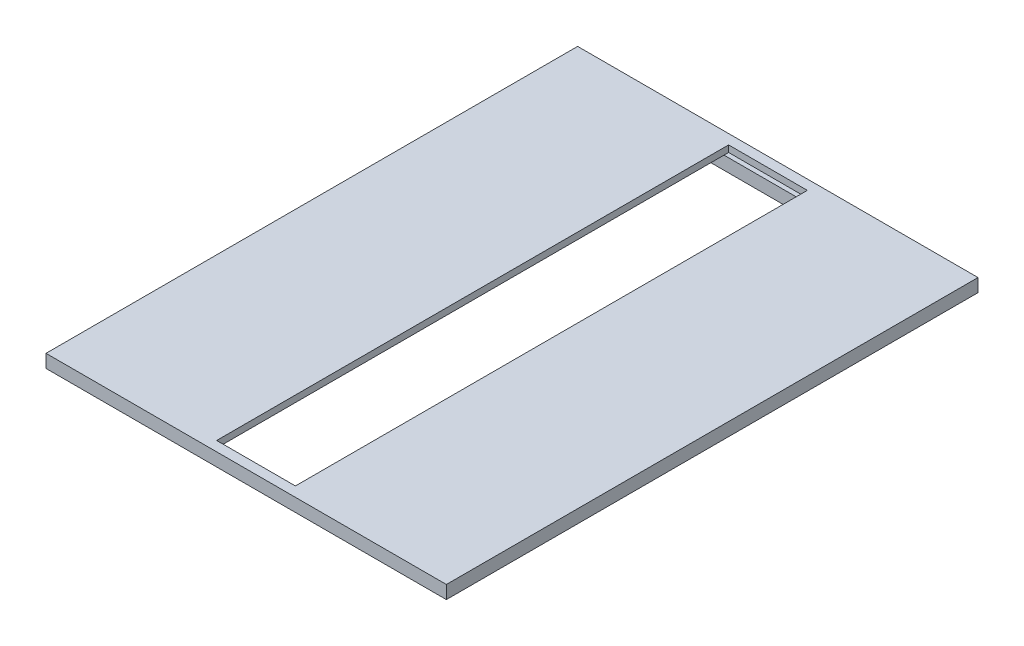
ISO-10303-21;
HEADER;
FILE_DESCRIPTION(('STEP AP214'),'2;1');
FILE_NAME('part.step','',(''),(''),'','','');
FILE_SCHEMA(('AUTOMOTIVE_DESIGN { 1 0 10303 214 1 1 1 1 }'));
ENDSEC;
DATA;
#1=APPLICATION_CONTEXT('core data for automotive mechanical design processes');
#2=APPLICATION_PROTOCOL_DEFINITION('international standard','automotive_design',2000,#1);
#3=PRODUCT_CONTEXT('',#1,'mechanical');
#4=PRODUCT('Part','Part','',(#3));
#5=PRODUCT_RELATED_PRODUCT_CATEGORY('part','',(#4));
#6=PRODUCT_DEFINITION_FORMATION('','',#4);
#7=PRODUCT_DEFINITION_CONTEXT('part definition',#1,'design');
#8=PRODUCT_DEFINITION('design','',#6,#7);
#9=PRODUCT_DEFINITION_SHAPE('','',#8);
#10=(LENGTH_UNIT() NAMED_UNIT(*) SI_UNIT(.MILLI.,.METRE.));
#11=(NAMED_UNIT(*) PLANE_ANGLE_UNIT() SI_UNIT($,.RADIAN.));
#12=(NAMED_UNIT(*) SI_UNIT($,.STERADIAN.) SOLID_ANGLE_UNIT());
#13=UNCERTAINTY_MEASURE_WITH_UNIT(LENGTH_MEASURE(1.E-05),#10,'distance_accuracy_value','');
#14=(GEOMETRIC_REPRESENTATION_CONTEXT(3) GLOBAL_UNCERTAINTY_ASSIGNED_CONTEXT((#13)) GLOBAL_UNIT_ASSIGNED_CONTEXT((#10,
#11,#12)) REPRESENTATION_CONTEXT('',''));
#15=CARTESIAN_POINT('',(0.,0.,0.));
#16=DIRECTION('',(0.,0.,1.));
#17=DIRECTION('',(1.,0.,0.));
#18=AXIS2_PLACEMENT_3D('',#15,#16,#17);
#19=CARTESIAN_POINT('',(0.,-2.5,0.));
#20=DIRECTION('',(0.,-1.,0.));
#21=DIRECTION('',(0.,0.,-1.));
#22=AXIS2_PLACEMENT_3D('',#19,#20,#21);
#23=PLANE('',#22);
#24=DIRECTION('',(-1.,0.,0.));
#25=VECTOR('',#24,1.);
#26=CARTESIAN_POINT('',(-70.75,-2.5,95.75));
#27=LINE('',#26,#25);
#28=CARTESIAN_POINT('',(70.75,-2.5,95.75));
#29=VERTEX_POINT('',#28);
#30=CARTESIAN_POINT('',(15.,-2.5,95.75));
#31=VERTEX_POINT('',#30);
#32=EDGE_CURVE('E339',#29,#31,#27,.T.);
#33=ORIENTED_EDGE('',*,*,#32,.T.);
#34=DIRECTION('',(0.,0.,-1.));
#35=VECTOR('',#34,1.);
#36=CARTESIAN_POINT('',(15.,-2.5,97.5));
#37=LINE('',#36,#35);
#38=CARTESIAN_POINT('',(15.,-2.5,-95.75));
#39=VERTEX_POINT('',#38);
#40=EDGE_CURVE('E303',#31,#39,#37,.T.);
#41=ORIENTED_EDGE('',*,*,#40,.T.);
#42=DIRECTION('',(1.,0.,0.));
#43=VECTOR('',#42,1.);
#44=CARTESIAN_POINT('',(70.75,-2.5,-95.75));
#45=LINE('',#44,#43);
#46=CARTESIAN_POINT('',(70.75,-2.5,-95.75));
#47=VERTEX_POINT('',#46);
#48=EDGE_CURVE('E345',#39,#47,#45,.T.);
#49=ORIENTED_EDGE('',*,*,#48,.T.);
#50=DIRECTION('',(0.,0.,1.));
#51=VECTOR('',#50,1.);
#52=CARTESIAN_POINT('',(70.75,-2.5,-95.75));
#53=LINE('',#52,#51);
#54=EDGE_CURVE('E319',#47,#29,#53,.T.);
#55=ORIENTED_EDGE('',*,*,#54,.T.);
#56=EDGE_LOOP('',(#33,#41,#49,#55));
#57=FACE_BOUND('',#56,.T.);
#58=DIRECTION('',(-1.,0.,0.));
#59=VECTOR('',#58,1.);
#60=CARTESIAN_POINT('',(25.,-2.5,92.75));
#61=LINE('',#60,#59);
#62=CARTESIAN_POINT('',(25.,-2.5,92.75));
#63=VERTEX_POINT('',#62);
#64=CARTESIAN_POINT('',(20.,-2.5,92.75));
#65=VERTEX_POINT('',#64);
#66=EDGE_CURVE('E774',#63,#65,#61,.T.);
#67=ORIENTED_EDGE('',*,*,#66,.F.);
#68=DIRECTION('',(0.,0.,1.));
#69=VECTOR('',#68,1.);
#70=CARTESIAN_POINT('',(25.,-2.5,92.75));
#71=LINE('',#70,#69);
#72=CARTESIAN_POINT('',(25.,-2.5,-92.75));
#73=VERTEX_POINT('',#72);
#74=EDGE_CURVE('E256',#73,#63,#71,.T.);
#75=ORIENTED_EDGE('',*,*,#74,.F.);
#76=DIRECTION('',(1.,0.,0.));
#77=VECTOR('',#76,1.);
#78=CARTESIAN_POINT('',(25.,-2.5,-92.75));
#79=LINE('',#78,#77);
#80=CARTESIAN_POINT('',(20.,-2.5,-92.75));
#81=VERTEX_POINT('',#80);
#82=EDGE_CURVE('E252',#81,#73,#79,.T.);
#83=ORIENTED_EDGE('',*,*,#82,.F.);
#84=DIRECTION('',(0.,0.,-1.));
#85=VECTOR('',#84,1.);
#86=CARTESIAN_POINT('',(20.,-2.5,-92.75));
#87=LINE('',#86,#85);
#88=EDGE_CURVE('E771',#65,#81,#87,.T.);
#89=ORIENTED_EDGE('',*,*,#88,.F.);
#90=EDGE_LOOP('',(#67,#75,#83,#89));
#91=FACE_BOUND('',#90,.T.);
#92=ADVANCED_FACE('F34',(#57,#91),#23,.T.);
#93=CARTESIAN_POINT('',(-70.75,-2.5,-95.75));
#94=VERTEX_POINT('',#93);
#95=CARTESIAN_POINT('',(-15.,-2.5,-95.75));
#96=VERTEX_POINT('',#95);
#97=EDGE_CURVE('E329',#94,#96,#45,.T.);
#98=ORIENTED_EDGE('',*,*,#97,.T.);
#99=DIRECTION('',(0.,0.,1.));
#100=VECTOR('',#99,1.);
#101=CARTESIAN_POINT('',(-15.,-2.5,97.5));
#102=LINE('',#101,#100);
#103=CARTESIAN_POINT('',(-15.,-2.5,95.75));
#104=VERTEX_POINT('',#103);
#105=EDGE_CURVE('E294',#96,#104,#102,.T.);
#106=ORIENTED_EDGE('',*,*,#105,.T.);
#107=CARTESIAN_POINT('',(-70.75,-2.5,95.75));
#108=VERTEX_POINT('',#107);
#109=EDGE_CURVE('E338',#104,#108,#27,.T.);
#110=ORIENTED_EDGE('',*,*,#109,.T.);
#111=DIRECTION('',(0.,0.,-1.));
#112=VECTOR('',#111,1.);
#113=CARTESIAN_POINT('',(-70.75,-2.5,-95.75));
#114=LINE('',#113,#112);
#115=EDGE_CURVE('E342',#108,#94,#114,.T.);
#116=ORIENTED_EDGE('',*,*,#115,.T.);
#117=EDGE_LOOP('',(#98,#106,#110,#116));
#118=FACE_BOUND('',#117,.T.);
#119=DIRECTION('',(0.,0.,-1.));
#120=VECTOR('',#119,1.);
#121=CARTESIAN_POINT('',(-25.,-2.5,92.75));
#122=LINE('',#121,#120);
#123=CARTESIAN_POINT('',(-25.,-2.5,92.75));
#124=VERTEX_POINT('',#123);
#125=CARTESIAN_POINT('',(-25.,-2.5,-92.75));
#126=VERTEX_POINT('',#125);
#127=EDGE_CURVE('E261',#124,#126,#122,.T.);
#128=ORIENTED_EDGE('',*,*,#127,.F.);
#129=DIRECTION('',(-1.,0.,0.));
#130=VECTOR('',#129,1.);
#131=CARTESIAN_POINT('',(-25.,-2.5,92.75));
#132=LINE('',#131,#130);
#133=CARTESIAN_POINT('',(-20.,-2.5,92.75));
#134=VERTEX_POINT('',#133);
#135=EDGE_CURVE('E258',#134,#124,#132,.T.);
#136=ORIENTED_EDGE('',*,*,#135,.F.);
#137=DIRECTION('',(0.,0.,1.));
#138=VECTOR('',#137,1.);
#139=CARTESIAN_POINT('',(-20.,-2.5,-92.75));
#140=LINE('',#139,#138);
#141=CARTESIAN_POINT('',(-20.,-2.5,-92.75));
#142=VERTEX_POINT('',#141);
#143=EDGE_CURVE('E270',#142,#134,#140,.T.);
#144=ORIENTED_EDGE('',*,*,#143,.F.);
#145=DIRECTION('',(1.,0.,0.));
#146=VECTOR('',#145,1.);
#147=CARTESIAN_POINT('',(-25.,-2.5,-92.75));
#148=LINE('',#147,#146);
#149=EDGE_CURVE('E278',#126,#142,#148,.T.);
#150=ORIENTED_EDGE('',*,*,#149,.F.);
#151=EDGE_LOOP('',(#128,#136,#144,#150));
#152=FACE_BOUND('',#151,.T.);
#153=ADVANCED_FACE('F473',(#118,#152),#23,.T.);
#154=DIRECTION('',(0.,0.,-1.));
#155=VECTOR('',#154,1.);
#156=CARTESIAN_POINT('',(-75.75,-2.5,-100.75));
#157=LINE('',#156,#155);
#158=CARTESIAN_POINT('',(-75.75,-2.5,100.75));
#159=VERTEX_POINT('',#158);
#160=CARTESIAN_POINT('',(-75.75,-2.5,-100.75));
#161=VERTEX_POINT('',#160);
#162=EDGE_CURVE('E390',#159,#161,#157,.T.);
#163=ORIENTED_EDGE('',*,*,#162,.T.);
#164=DIRECTION('',(1.,0.,0.));
#165=VECTOR('',#164,1.);
#166=CARTESIAN_POINT('',(75.75,-2.5,-100.75));
#167=LINE('',#166,#165);
#168=CARTESIAN_POINT('',(75.75,-2.5,-100.75));
#169=VERTEX_POINT('',#168);
#170=EDGE_CURVE('E393',#161,#169,#167,.T.);
#171=ORIENTED_EDGE('',*,*,#170,.T.);
#172=DIRECTION('',(0.,0.,1.));
#173=VECTOR('',#172,1.);
#174=CARTESIAN_POINT('',(75.75,-2.5,-100.75));
#175=LINE('',#174,#173);
#176=CARTESIAN_POINT('',(75.75,-2.5,100.75));
#177=VERTEX_POINT('',#176);
#178=EDGE_CURVE('E397',#169,#177,#175,.T.);
#179=ORIENTED_EDGE('',*,*,#178,.T.);
#180=DIRECTION('',(-1.,0.,0.));
#181=VECTOR('',#180,1.);
#182=CARTESIAN_POINT('',(75.75,-2.5,100.75));
#183=LINE('',#182,#181);
#184=EDGE_CURVE('E400',#177,#159,#183,.T.);
#185=ORIENTED_EDGE('',*,*,#184,.T.);
#186=EDGE_LOOP('',(#163,#171,#179,#185));
#187=FACE_BOUND('',#186,.T.);
#188=DIRECTION('',(1.,0.,0.));
#189=VECTOR('',#188,1.);
#190=CARTESIAN_POINT('',(-73.25,-2.5,-98.25));
#191=LINE('',#190,#189);
#192=CARTESIAN_POINT('',(-73.25,-2.5,-98.25));
#193=VERTEX_POINT('',#192);
#194=CARTESIAN_POINT('',(73.25,-2.5,-98.25));
#195=VERTEX_POINT('',#194);
#196=EDGE_CURVE('E374',#193,#195,#191,.T.);
#197=ORIENTED_EDGE('',*,*,#196,.F.);
#198=DIRECTION('',(0.,0.,-1.));
#199=VECTOR('',#198,1.);
#200=CARTESIAN_POINT('',(-73.25,-2.5,98.25));
#201=LINE('',#200,#199);
#202=CARTESIAN_POINT('',(-73.25,-2.5,98.25));
#203=VERTEX_POINT('',#202);
#204=EDGE_CURVE('E360',#203,#193,#201,.T.);
#205=ORIENTED_EDGE('',*,*,#204,.F.);
#206=DIRECTION('',(-1.,0.,0.));
#207=VECTOR('',#206,1.);
#208=CARTESIAN_POINT('',(73.25,-2.5,98.25));
#209=LINE('',#208,#207);
#210=CARTESIAN_POINT('',(73.25,-2.5,98.25));
#211=VERTEX_POINT('',#210);
#212=EDGE_CURVE('E365',#211,#203,#209,.T.);
#213=ORIENTED_EDGE('',*,*,#212,.F.);
#214=DIRECTION('',(0.,0.,1.));
#215=VECTOR('',#214,1.);
#216=CARTESIAN_POINT('',(73.25,-2.5,98.25));
#217=LINE('',#216,#215);
#218=EDGE_CURVE('E376',#195,#211,#217,.T.);
#219=ORIENTED_EDGE('',*,*,#218,.F.);
#220=EDGE_LOOP('',(#197,#205,#213,#219));
#221=FACE_BOUND('',#220,.T.);
#222=ADVANCED_FACE('F476',(#187,#221),#23,.T.);
#223=CARTESIAN_POINT('',(-76.25,-5.,101.25));
#224=DIRECTION('',(-1.,0.,0.));
#225=DIRECTION('',(0.,0.,1.));
#226=AXIS2_PLACEMENT_3D('',#223,#224,#225);
#227=PLANE('',#226);
#228=DIRECTION('',(0.,0.,1.));
#229=VECTOR('',#228,1.);
#230=CARTESIAN_POINT('',(-76.25,0.,101.25));
#231=LINE('',#230,#229);
#232=CARTESIAN_POINT('',(-76.25,0.,-101.25));
#233=VERTEX_POINT('',#232);
#234=CARTESIAN_POINT('',(-76.25,0.,101.25));
#235=VERTEX_POINT('',#234);
#236=EDGE_CURVE('E415',#233,#235,#231,.T.);
#237=ORIENTED_EDGE('',*,*,#236,.F.);
#238=DIRECTION('',(0.,1.,0.));
#239=VECTOR('',#238,1.);
#240=CARTESIAN_POINT('',(-76.25,-5.,-101.25));
#241=LINE('',#240,#239);
#242=CARTESIAN_POINT('',(-76.25,-5.,-101.25));
#243=VERTEX_POINT('',#242);
#244=EDGE_CURVE('E11',#243,#233,#241,.T.);
#245=ORIENTED_EDGE('',*,*,#244,.F.);
#246=DIRECTION('',(0.,0.,1.));
#247=VECTOR('',#246,1.);
#248=CARTESIAN_POINT('',(-76.25,-5.,101.25));
#249=LINE('',#248,#247);
#250=CARTESIAN_POINT('',(-76.25,-5.,101.25));
#251=VERTEX_POINT('',#250);
#252=EDGE_CURVE('E422',#243,#251,#249,.T.);
#253=ORIENTED_EDGE('',*,*,#252,.T.);
#254=DIRECTION('',(0.,1.,0.));
#255=VECTOR('',#254,1.);
#256=CARTESIAN_POINT('',(-76.25,-5.,101.25));
#257=LINE('',#256,#255);
#258=EDGE_CURVE('E38',#251,#235,#257,.T.);
#259=ORIENTED_EDGE('',*,*,#258,.T.);
#260=EDGE_LOOP('',(#237,#245,#253,#259));
#261=FACE_BOUND('',#260,.T.);
#262=ADVANCED_FACE('F36',(#261),#227,.T.);
#263=CARTESIAN_POINT('',(76.25,-5.,-101.25));
#264=DIRECTION('',(0.,0.,-1.));
#265=DIRECTION('',(-1.,0.,0.));
#266=AXIS2_PLACEMENT_3D('',#263,#264,#265);
#267=PLANE('',#266);
#268=DIRECTION('',(-1.,0.,0.));
#269=VECTOR('',#268,1.);
#270=CARTESIAN_POINT('',(76.25,0.,-101.25));
#271=LINE('',#270,#269);
#272=CARTESIAN_POINT('',(76.25,0.,-101.25));
#273=VERTEX_POINT('',#272);
#274=EDGE_CURVE('E426',#273,#233,#271,.T.);
#275=ORIENTED_EDGE('',*,*,#274,.F.);
#276=DIRECTION('',(0.,1.,0.));
#277=VECTOR('',#276,1.);
#278=CARTESIAN_POINT('',(76.25,-5.,-101.25));
#279=LINE('',#278,#277);
#280=CARTESIAN_POINT('',(76.25,-5.,-101.25));
#281=VERTEX_POINT('',#280);
#282=EDGE_CURVE('E43',#281,#273,#279,.T.);
#283=ORIENTED_EDGE('',*,*,#282,.F.);
#284=DIRECTION('',(-1.,0.,0.));
#285=VECTOR('',#284,1.);
#286=CARTESIAN_POINT('',(76.25,-5.,-101.25));
#287=LINE('',#286,#285);
#288=EDGE_CURVE('E432',#281,#243,#287,.T.);
#289=ORIENTED_EDGE('',*,*,#288,.T.);
#290=ORIENTED_EDGE('',*,*,#244,.T.);
#291=EDGE_LOOP('',(#275,#283,#289,#290));
#292=FACE_BOUND('',#291,.T.);
#293=ADVANCED_FACE('F458',(#292),#267,.T.);
#294=CARTESIAN_POINT('',(76.25,-5.,101.25));
#295=DIRECTION('',(1.,0.,0.));
#296=DIRECTION('',(0.,0.,-1.));
#297=AXIS2_PLACEMENT_3D('',#294,#295,#296);
#298=PLANE('',#297);
#299=DIRECTION('',(0.,0.,-1.));
#300=VECTOR('',#299,1.);
#301=CARTESIAN_POINT('',(76.25,0.,101.25));
#302=LINE('',#301,#300);
#303=CARTESIAN_POINT('',(76.25,0.,101.25));
#304=VERTEX_POINT('',#303);
#305=EDGE_CURVE('E440',#304,#273,#302,.T.);
#306=ORIENTED_EDGE('',*,*,#305,.F.);
#307=DIRECTION('',(0.,1.,0.));
#308=VECTOR('',#307,1.);
#309=CARTESIAN_POINT('',(76.25,-5.,101.25));
#310=LINE('',#309,#308);
#311=CARTESIAN_POINT('',(76.25,-5.,101.25));
#312=VERTEX_POINT('',#311);
#313=EDGE_CURVE('E445',#312,#304,#310,.T.);
#314=ORIENTED_EDGE('',*,*,#313,.F.);
#315=DIRECTION('',(0.,0.,-1.));
#316=VECTOR('',#315,1.);
#317=CARTESIAN_POINT('',(76.25,-5.,101.25));
#318=LINE('',#317,#316);
#319=EDGE_CURVE('E429',#312,#281,#318,.T.);
#320=ORIENTED_EDGE('',*,*,#319,.T.);
#321=ORIENTED_EDGE('',*,*,#282,.T.);
#322=EDGE_LOOP('',(#306,#314,#320,#321));
#323=FACE_BOUND('',#322,.T.);
#324=ADVANCED_FACE('F464',(#323),#298,.T.);
#325=CARTESIAN_POINT('',(76.25,-5.,101.25));
#326=DIRECTION('',(0.,0.,1.));
#327=DIRECTION('',(1.,0.,0.));
#328=AXIS2_PLACEMENT_3D('',#325,#326,#327);
#329=PLANE('',#328);
#330=DIRECTION('',(1.,0.,0.));
#331=VECTOR('',#330,1.);
#332=CARTESIAN_POINT('',(76.25,0.,101.25));
#333=LINE('',#332,#331);
#334=EDGE_CURVE('E437',#235,#304,#333,.T.);
#335=ORIENTED_EDGE('',*,*,#334,.F.);
#336=ORIENTED_EDGE('',*,*,#258,.F.);
#337=DIRECTION('',(1.,0.,0.));
#338=VECTOR('',#337,1.);
#339=CARTESIAN_POINT('',(76.25,-5.,101.25));
#340=LINE('',#339,#338);
#341=EDGE_CURVE('E425',#251,#312,#340,.T.);
#342=ORIENTED_EDGE('',*,*,#341,.T.);
#343=ORIENTED_EDGE('',*,*,#313,.T.);
#344=EDGE_LOOP('',(#335,#336,#342,#343));
#345=FACE_BOUND('',#344,.T.);
#346=ADVANCED_FACE('F453',(#345),#329,.T.);
#347=CARTESIAN_POINT('',(0.,-5.,0.));
#348=DIRECTION('',(0.,1.,0.));
#349=DIRECTION('',(0.,0.,1.));
#350=AXIS2_PLACEMENT_3D('',#347,#348,#349);
#351=PLANE('',#350);
#352=DIRECTION('',(1.,0.,0.));
#353=VECTOR('',#352,1.);
#354=CARTESIAN_POINT('',(75.75,-5.,-100.75));
#355=LINE('',#354,#353);
#356=CARTESIAN_POINT('',(-75.75,-5.,-100.75));
#357=VERTEX_POINT('',#356);
#358=CARTESIAN_POINT('',(75.75,-5.,-100.75));
#359=VERTEX_POINT('',#358);
#360=EDGE_CURVE('E405',#357,#359,#355,.T.);
#361=ORIENTED_EDGE('',*,*,#360,.F.);
#362=DIRECTION('',(0.,0.,-1.));
#363=VECTOR('',#362,1.);
#364=CARTESIAN_POINT('',(-75.75,-5.,-100.75));
#365=LINE('',#364,#363);
#366=CARTESIAN_POINT('',(-75.75,-5.,100.75));
#367=VERTEX_POINT('',#366);
#368=EDGE_CURVE('E389',#367,#357,#365,.T.);
#369=ORIENTED_EDGE('',*,*,#368,.F.);
#370=DIRECTION('',(-1.,0.,0.));
#371=VECTOR('',#370,1.);
#372=CARTESIAN_POINT('',(75.75,-5.,100.75));
#373=LINE('',#372,#371);
#374=CARTESIAN_POINT('',(75.75,-5.,100.75));
#375=VERTEX_POINT('',#374);
#376=EDGE_CURVE('E394',#375,#367,#373,.T.);
#377=ORIENTED_EDGE('',*,*,#376,.F.);
#378=DIRECTION('',(0.,0.,1.));
#379=VECTOR('',#378,1.);
#380=CARTESIAN_POINT('',(75.75,-5.,-100.75));
#381=LINE('',#380,#379);
#382=EDGE_CURVE('E408',#359,#375,#381,.T.);
#383=ORIENTED_EDGE('',*,*,#382,.F.);
#384=EDGE_LOOP('',(#361,#369,#377,#383));
#385=FACE_BOUND('',#384,.T.);
#386=ORIENTED_EDGE('',*,*,#252,.F.);
#387=ORIENTED_EDGE('',*,*,#288,.F.);
#388=ORIENTED_EDGE('',*,*,#319,.F.);
#389=ORIENTED_EDGE('',*,*,#341,.F.);
#390=EDGE_LOOP('',(#386,#387,#388,#389));
#391=FACE_BOUND('',#390,.T.);
#392=ADVANCED_FACE('F461',(#385,#391),#351,.F.);
#393=CARTESIAN_POINT('',(0.,0.,0.));
#394=DIRECTION('',(0.,1.,0.));
#395=DIRECTION('',(0.,0.,1.));
#396=AXIS2_PLACEMENT_3D('',#393,#394,#395);
#397=PLANE('',#396);
#398=DIRECTION('',(0.,0.,1.));
#399=VECTOR('',#398,1.);
#400=CARTESIAN_POINT('',(-15.,0.,97.5));
#401=LINE('',#400,#399);
#402=CARTESIAN_POINT('',(-15.,0.,-97.5));
#403=VERTEX_POINT('',#402);
#404=CARTESIAN_POINT('',(-15.,0.,97.5));
#405=VERTEX_POINT('',#404);
#406=EDGE_CURVE('E289',#403,#405,#401,.T.);
#407=ORIENTED_EDGE('',*,*,#406,.F.);
#408=DIRECTION('',(-1.,0.,0.));
#409=VECTOR('',#408,1.);
#410=CARTESIAN_POINT('',(15.,0.,-97.5));
#411=LINE('',#410,#409);
#412=CARTESIAN_POINT('',(15.,0.,-97.5));
#413=VERTEX_POINT('',#412);
#414=EDGE_CURVE('E314',#413,#403,#411,.T.);
#415=ORIENTED_EDGE('',*,*,#414,.F.);
#416=DIRECTION('',(0.,0.,-1.));
#417=VECTOR('',#416,1.);
#418=CARTESIAN_POINT('',(15.,0.,97.5));
#419=LINE('',#418,#417);
#420=CARTESIAN_POINT('',(15.,0.,97.5));
#421=VERTEX_POINT('',#420);
#422=EDGE_CURVE('E311',#421,#413,#419,.T.);
#423=ORIENTED_EDGE('',*,*,#422,.F.);
#424=DIRECTION('',(1.,0.,0.));
#425=VECTOR('',#424,1.);
#426=CARTESIAN_POINT('',(15.,0.,97.5));
#427=LINE('',#426,#425);
#428=EDGE_CURVE('E308',#405,#421,#427,.T.);
#429=ORIENTED_EDGE('',*,*,#428,.F.);
#430=EDGE_LOOP('',(#407,#415,#423,#429));
#431=FACE_BOUND('',#430,.T.);
#432=ORIENTED_EDGE('',*,*,#236,.T.);
#433=ORIENTED_EDGE('',*,*,#334,.T.);
#434=ORIENTED_EDGE('',*,*,#305,.T.);
#435=ORIENTED_EDGE('',*,*,#274,.T.);
#436=EDGE_LOOP('',(#432,#433,#434,#435));
#437=FACE_BOUND('',#436,.T.);
#438=ADVANCED_FACE('F455',(#431,#437),#397,.T.);
#439=CARTESIAN_POINT('',(-75.75,-2.5,-100.75));
#440=DIRECTION('',(-1.,0.,0.));
#441=DIRECTION('',(0.,0.,1.));
#442=AXIS2_PLACEMENT_3D('',#439,#440,#441);
#443=PLANE('',#442);
#444=ORIENTED_EDGE('',*,*,#368,.T.);
#445=DIRECTION('',(0.,-1.,0.));
#446=VECTOR('',#445,1.);
#447=CARTESIAN_POINT('',(-75.75,-2.5,-100.75));
#448=LINE('',#447,#446);
#449=EDGE_CURVE('E403',#161,#357,#448,.T.);
#450=ORIENTED_EDGE('',*,*,#449,.F.);
#451=ORIENTED_EDGE('',*,*,#162,.F.);
#452=DIRECTION('',(0.,-1.,0.));
#453=VECTOR('',#452,1.);
#454=CARTESIAN_POINT('',(-75.75,-2.5,100.75));
#455=LINE('',#454,#453);
#456=EDGE_CURVE('E413',#159,#367,#455,.T.);
#457=ORIENTED_EDGE('',*,*,#456,.T.);
#458=EDGE_LOOP('',(#444,#450,#451,#457));
#459=FACE_BOUND('',#458,.T.);
#460=ADVANCED_FACE('F545',(#459),#443,.F.);
#461=CARTESIAN_POINT('',(75.75,-2.5,100.75));
#462=DIRECTION('',(0.,0.,1.));
#463=DIRECTION('',(1.,0.,0.));
#464=AXIS2_PLACEMENT_3D('',#461,#462,#463);
#465=PLANE('',#464);
#466=ORIENTED_EDGE('',*,*,#376,.T.);
#467=ORIENTED_EDGE('',*,*,#456,.F.);
#468=ORIENTED_EDGE('',*,*,#184,.F.);
#469=DIRECTION('',(0.,-1.,0.));
#470=VECTOR('',#469,1.);
#471=CARTESIAN_POINT('',(75.75,-2.5,100.75));
#472=LINE('',#471,#470);
#473=EDGE_CURVE('E416',#177,#375,#472,.T.);
#474=ORIENTED_EDGE('',*,*,#473,.T.);
#475=EDGE_LOOP('',(#466,#467,#468,#474));
#476=FACE_BOUND('',#475,.T.);
#477=ADVANCED_FACE('F541',(#476),#465,.F.);
#478=CARTESIAN_POINT('',(75.75,-2.5,-100.75));
#479=DIRECTION('',(1.,0.,0.));
#480=DIRECTION('',(0.,0.,-1.));
#481=AXIS2_PLACEMENT_3D('',#478,#479,#480);
#482=PLANE('',#481);
#483=ORIENTED_EDGE('',*,*,#382,.T.);
#484=ORIENTED_EDGE('',*,*,#473,.F.);
#485=ORIENTED_EDGE('',*,*,#178,.F.);
#486=DIRECTION('',(0.,-1.,0.));
#487=VECTOR('',#486,1.);
#488=CARTESIAN_POINT('',(75.75,-2.5,-100.75));
#489=LINE('',#488,#487);
#490=EDGE_CURVE('E418',#169,#359,#489,.T.);
#491=ORIENTED_EDGE('',*,*,#490,.T.);
#492=EDGE_LOOP('',(#483,#484,#485,#491));
#493=FACE_BOUND('',#492,.T.);
#494=ADVANCED_FACE('F535',(#493),#482,.F.);
#495=CARTESIAN_POINT('',(75.75,-2.5,-100.75));
#496=DIRECTION('',(0.,0.,-1.));
#497=DIRECTION('',(-1.,0.,0.));
#498=AXIS2_PLACEMENT_3D('',#495,#496,#497);
#499=PLANE('',#498);
#500=ORIENTED_EDGE('',*,*,#360,.T.);
#501=ORIENTED_EDGE('',*,*,#490,.F.);
#502=ORIENTED_EDGE('',*,*,#170,.F.);
#503=ORIENTED_EDGE('',*,*,#449,.T.);
#504=EDGE_LOOP('',(#500,#501,#502,#503));
#505=FACE_BOUND('',#504,.T.);
#506=ADVANCED_FACE('F531',(#505),#499,.F.);
#507=CARTESIAN_POINT('',(0.,-7.5,0.));
#508=DIRECTION('',(0.,-1.,0.));
#509=DIRECTION('',(0.,0.,-1.));
#510=AXIS2_PLACEMENT_3D('',#507,#508,#509);
#511=PLANE('',#510);
#512=DIRECTION('',(0.,0.,-1.));
#513=VECTOR('',#512,1.);
#514=CARTESIAN_POINT('',(-73.25,-7.5,98.25));
#515=LINE('',#514,#513);
#516=CARTESIAN_POINT('',(-73.25,-7.5,98.25));
#517=VERTEX_POINT('',#516);
#518=CARTESIAN_POINT('',(-73.25,-7.5,-98.25));
#519=VERTEX_POINT('',#518);
#520=EDGE_CURVE('E361',#517,#519,#515,.T.);
#521=ORIENTED_EDGE('',*,*,#520,.T.);
#522=DIRECTION('',(1.,0.,0.));
#523=VECTOR('',#522,1.);
#524=CARTESIAN_POINT('',(-73.25,-7.5,-98.25));
#525=LINE('',#524,#523);
#526=CARTESIAN_POINT('',(73.25,-7.5,-98.25));
#527=VERTEX_POINT('',#526);
#528=EDGE_CURVE('E364',#519,#527,#525,.T.);
#529=ORIENTED_EDGE('',*,*,#528,.T.);
#530=DIRECTION('',(0.,0.,1.));
#531=VECTOR('',#530,1.);
#532=CARTESIAN_POINT('',(73.25,-7.5,98.25));
#533=LINE('',#532,#531);
#534=CARTESIAN_POINT('',(73.25,-7.5,98.25));
#535=VERTEX_POINT('',#534);
#536=EDGE_CURVE('E367',#527,#535,#533,.T.);
#537=ORIENTED_EDGE('',*,*,#536,.T.);
#538=DIRECTION('',(-1.,0.,0.));
#539=VECTOR('',#538,1.);
#540=CARTESIAN_POINT('',(73.25,-7.5,98.25));
#541=LINE('',#540,#539);
#542=EDGE_CURVE('E369',#535,#517,#541,.T.);
#543=ORIENTED_EDGE('',*,*,#542,.T.);
#544=EDGE_LOOP('',(#521,#529,#537,#543));
#545=FACE_BOUND('',#544,.T.);
#546=DIRECTION('',(-1.,0.,0.));
#547=VECTOR('',#546,1.);
#548=CARTESIAN_POINT('',(-70.75,-7.5,95.75));
#549=LINE('',#548,#547);
#550=CARTESIAN_POINT('',(70.75,-7.5,95.75));
#551=VERTEX_POINT('',#550);
#552=CARTESIAN_POINT('',(-70.75,-7.5,95.75));
#553=VERTEX_POINT('',#552);
#554=EDGE_CURVE('E328',#551,#553,#549,.T.);
#555=ORIENTED_EDGE('',*,*,#554,.F.);
#556=DIRECTION('',(0.,0.,1.));
#557=VECTOR('',#556,1.);
#558=CARTESIAN_POINT('',(70.75,-7.5,-95.75));
#559=LINE('',#558,#557);
#560=CARTESIAN_POINT('',(70.75,-7.5,-95.75));
#561=VERTEX_POINT('',#560);
#562=EDGE_CURVE('E326',#561,#551,#559,.T.);
#563=ORIENTED_EDGE('',*,*,#562,.F.);
#564=DIRECTION('',(1.,0.,0.));
#565=VECTOR('',#564,1.);
#566=CARTESIAN_POINT('',(70.75,-7.5,-95.75));
#567=LINE('',#566,#565);
#568=CARTESIAN_POINT('',(-70.75,-7.5,-95.75));
#569=VERTEX_POINT('',#568);
#570=EDGE_CURVE('E334',#569,#561,#567,.T.);
#571=ORIENTED_EDGE('',*,*,#570,.F.);
#572=DIRECTION('',(0.,0.,-1.));
#573=VECTOR('',#572,1.);
#574=CARTESIAN_POINT('',(-70.75,-7.5,-95.75));
#575=LINE('',#574,#573);
#576=EDGE_CURVE('E331',#553,#569,#575,.T.);
#577=ORIENTED_EDGE('',*,*,#576,.F.);
#578=EDGE_LOOP('',(#555,#563,#571,#577));
#579=FACE_BOUND('',#578,.T.);
#580=ADVANCED_FACE('F505',(#545,#579),#511,.T.);
#581=CARTESIAN_POINT('',(-73.25,-7.5,98.25));
#582=DIRECTION('',(1.,0.,0.));
#583=DIRECTION('',(0.,0.,-1.));
#584=AXIS2_PLACEMENT_3D('',#581,#582,#583);
#585=PLANE('',#584);
#586=ORIENTED_EDGE('',*,*,#204,.T.);
#587=DIRECTION('',(0.,1.,0.));
#588=VECTOR('',#587,1.);
#589=CARTESIAN_POINT('',(-73.25,-7.5,-98.25));
#590=LINE('',#589,#588);
#591=EDGE_CURVE('E387',#519,#193,#590,.T.);
#592=ORIENTED_EDGE('',*,*,#591,.F.);
#593=ORIENTED_EDGE('',*,*,#520,.F.);
#594=DIRECTION('',(0.,1.,0.));
#595=VECTOR('',#594,1.);
#596=CARTESIAN_POINT('',(-73.25,-7.5,98.25));
#597=LINE('',#596,#595);
#598=EDGE_CURVE('E371',#517,#203,#597,.T.);
#599=ORIENTED_EDGE('',*,*,#598,.T.);
#600=EDGE_LOOP('',(#586,#592,#593,#599));
#601=FACE_BOUND('',#600,.T.);
#602=ADVANCED_FACE('F510',(#601),#585,.F.);
#603=CARTESIAN_POINT('',(-73.25,-7.5,-98.25));
#604=DIRECTION('',(0.,0.,1.));
#605=DIRECTION('',(1.,0.,0.));
#606=AXIS2_PLACEMENT_3D('',#603,#604,#605);
#607=PLANE('',#606);
#608=ORIENTED_EDGE('',*,*,#196,.T.);
#609=DIRECTION('',(0.,1.,0.));
#610=VECTOR('',#609,1.);
#611=CARTESIAN_POINT('',(73.25,-7.5,-98.25));
#612=LINE('',#611,#610);
#613=EDGE_CURVE('E384',#527,#195,#612,.T.);
#614=ORIENTED_EDGE('',*,*,#613,.F.);
#615=ORIENTED_EDGE('',*,*,#528,.F.);
#616=ORIENTED_EDGE('',*,*,#591,.T.);
#617=EDGE_LOOP('',(#608,#614,#615,#616));
#618=FACE_BOUND('',#617,.T.);
#619=ADVANCED_FACE('F497',(#618),#607,.F.);
#620=CARTESIAN_POINT('',(73.25,-7.5,98.25));
#621=DIRECTION('',(-1.,0.,0.));
#622=DIRECTION('',(0.,0.,1.));
#623=AXIS2_PLACEMENT_3D('',#620,#621,#622);
#624=PLANE('',#623);
#625=ORIENTED_EDGE('',*,*,#218,.T.);
#626=DIRECTION('',(0.,1.,0.));
#627=VECTOR('',#626,1.);
#628=CARTESIAN_POINT('',(73.25,-7.5,98.25));
#629=LINE('',#628,#627);
#630=EDGE_CURVE('E382',#535,#211,#629,.T.);
#631=ORIENTED_EDGE('',*,*,#630,.F.);
#632=ORIENTED_EDGE('',*,*,#536,.F.);
#633=ORIENTED_EDGE('',*,*,#613,.T.);
#634=EDGE_LOOP('',(#625,#631,#632,#633));
#635=FACE_BOUND('',#634,.T.);
#636=ADVANCED_FACE('F501',(#635),#624,.F.);
#637=CARTESIAN_POINT('',(73.25,-7.5,98.25));
#638=DIRECTION('',(0.,0.,-1.));
#639=DIRECTION('',(-1.,0.,0.));
#640=AXIS2_PLACEMENT_3D('',#637,#638,#639);
#641=PLANE('',#640);
#642=ORIENTED_EDGE('',*,*,#212,.T.);
#643=ORIENTED_EDGE('',*,*,#598,.F.);
#644=ORIENTED_EDGE('',*,*,#542,.F.);
#645=ORIENTED_EDGE('',*,*,#630,.T.);
#646=EDGE_LOOP('',(#642,#643,#644,#645));
#647=FACE_BOUND('',#646,.T.);
#648=ADVANCED_FACE('F512',(#647),#641,.F.);
#649=CARTESIAN_POINT('',(70.75,-7.5,-95.75));
#650=DIRECTION('',(-1.,0.,0.));
#651=DIRECTION('',(0.,0.,1.));
#652=AXIS2_PLACEMENT_3D('',#649,#650,#651);
#653=PLANE('',#652);
#654=ORIENTED_EDGE('',*,*,#54,.F.);
#655=DIRECTION('',(0.,1.,0.));
#656=VECTOR('',#655,1.);
#657=CARTESIAN_POINT('',(70.75,-7.5,-95.75));
#658=LINE('',#657,#656);
#659=EDGE_CURVE('E336',#561,#47,#658,.T.);
#660=ORIENTED_EDGE('',*,*,#659,.F.);
#661=ORIENTED_EDGE('',*,*,#562,.T.);
#662=DIRECTION('',(0.,1.,0.));
#663=VECTOR('',#662,1.);
#664=CARTESIAN_POINT('',(70.75,-7.5,95.75));
#665=LINE('',#664,#663);
#666=EDGE_CURVE('E357',#551,#29,#665,.T.);
#667=ORIENTED_EDGE('',*,*,#666,.T.);
#668=EDGE_LOOP('',(#654,#660,#661,#667));
#669=FACE_BOUND('',#668,.T.);
#670=ADVANCED_FACE('F514',(#669),#653,.T.);
#671=CARTESIAN_POINT('',(-70.75,-7.5,95.75));
#672=DIRECTION('',(0.,0.,-1.));
#673=DIRECTION('',(-1.,0.,0.));
#674=AXIS2_PLACEMENT_3D('',#671,#672,#673);
#675=PLANE('',#674);
#676=ORIENTED_EDGE('',*,*,#32,.F.);
#677=ORIENTED_EDGE('',*,*,#666,.F.);
#678=ORIENTED_EDGE('',*,*,#554,.T.);
#679=DIRECTION('',(0.,1.,0.));
#680=VECTOR('',#679,1.);
#681=CARTESIAN_POINT('',(-70.75,-7.5,95.75));
#682=LINE('',#681,#680);
#683=EDGE_CURVE('E354',#553,#108,#682,.T.);
#684=ORIENTED_EDGE('',*,*,#683,.T.);
#685=ORIENTED_EDGE('',*,*,#109,.F.);
#686=EDGE_CURVE('E343',#31,#104,#27,.T.);
#687=ORIENTED_EDGE('',*,*,#686,.F.);
#688=EDGE_LOOP('',(#676,#677,#678,#684,#685,#687));
#689=FACE_BOUND('',#688,.T.);
#690=ADVANCED_FACE('F520',(#689),#675,.T.);
#691=CARTESIAN_POINT('',(-70.75,-7.5,-95.75));
#692=DIRECTION('',(1.,0.,0.));
#693=DIRECTION('',(0.,0.,-1.));
#694=AXIS2_PLACEMENT_3D('',#691,#692,#693);
#695=PLANE('',#694);
#696=ORIENTED_EDGE('',*,*,#115,.F.);
#697=ORIENTED_EDGE('',*,*,#683,.F.);
#698=ORIENTED_EDGE('',*,*,#576,.T.);
#699=DIRECTION('',(0.,1.,0.));
#700=VECTOR('',#699,1.);
#701=CARTESIAN_POINT('',(-70.75,-7.5,-95.75));
#702=LINE('',#701,#700);
#703=EDGE_CURVE('E351',#569,#94,#702,.T.);
#704=ORIENTED_EDGE('',*,*,#703,.T.);
#705=EDGE_LOOP('',(#696,#697,#698,#704));
#706=FACE_BOUND('',#705,.T.);
#707=ADVANCED_FACE('F584',(#706),#695,.T.);
#708=CARTESIAN_POINT('',(70.75,-7.5,-95.75));
#709=DIRECTION('',(0.,0.,1.));
#710=DIRECTION('',(1.,0.,0.));
#711=AXIS2_PLACEMENT_3D('',#708,#709,#710);
#712=PLANE('',#711);
#713=ORIENTED_EDGE('',*,*,#97,.F.);
#714=ORIENTED_EDGE('',*,*,#703,.F.);
#715=ORIENTED_EDGE('',*,*,#570,.T.);
#716=ORIENTED_EDGE('',*,*,#659,.T.);
#717=ORIENTED_EDGE('',*,*,#48,.F.);
#718=EDGE_CURVE('E348',#96,#39,#45,.T.);
#719=ORIENTED_EDGE('',*,*,#718,.F.);
#720=EDGE_LOOP('',(#713,#714,#715,#716,#717,#719));
#721=FACE_BOUND('',#720,.T.);
#722=ADVANCED_FACE('F588',(#721),#712,.T.);
#723=CARTESIAN_POINT('',(0.,-2.5,0.));
#724=DIRECTION('',(0.,1.,0.));
#725=DIRECTION('',(0.,0.,1.));
#726=AXIS2_PLACEMENT_3D('',#723,#724,#725);
#727=PLANE('',#726);
#728=ORIENTED_EDGE('',*,*,#686,.T.);
#729=CARTESIAN_POINT('',(-15.,-2.5,97.5));
#730=VERTEX_POINT('',#729);
#731=EDGE_CURVE('E295',#104,#730,#102,.T.);
#732=ORIENTED_EDGE('',*,*,#731,.T.);
#733=DIRECTION('',(1.,0.,0.));
#734=VECTOR('',#733,1.);
#735=CARTESIAN_POINT('',(15.,-2.5,97.5));
#736=LINE('',#735,#734);
#737=CARTESIAN_POINT('',(15.,-2.5,97.5));
#738=VERTEX_POINT('',#737);
#739=EDGE_CURVE('E293',#730,#738,#736,.T.);
#740=ORIENTED_EDGE('',*,*,#739,.T.);
#741=EDGE_CURVE('E299',#738,#31,#37,.T.);
#742=ORIENTED_EDGE('',*,*,#741,.T.);
#743=EDGE_LOOP('',(#728,#732,#740,#742));
#744=FACE_BOUND('',#743,.T.);
#745=ADVANCED_FACE('F570',(#744),#727,.T.);
#746=ORIENTED_EDGE('',*,*,#718,.T.);
#747=CARTESIAN_POINT('',(15.,-2.5,-97.5));
#748=VERTEX_POINT('',#747);
#749=EDGE_CURVE('E298',#39,#748,#37,.T.);
#750=ORIENTED_EDGE('',*,*,#749,.T.);
#751=DIRECTION('',(-1.,0.,0.));
#752=VECTOR('',#751,1.);
#753=CARTESIAN_POINT('',(15.,-2.5,-97.5));
#754=LINE('',#753,#752);
#755=CARTESIAN_POINT('',(-15.,-2.5,-97.5));
#756=VERTEX_POINT('',#755);
#757=EDGE_CURVE('E302',#748,#756,#754,.T.);
#758=ORIENTED_EDGE('',*,*,#757,.T.);
#759=EDGE_CURVE('E290',#756,#96,#102,.T.);
#760=ORIENTED_EDGE('',*,*,#759,.T.);
#761=EDGE_LOOP('',(#746,#750,#758,#760));
#762=FACE_BOUND('',#761,.T.);
#763=ADVANCED_FACE('F598',(#762),#727,.T.);
#764=CARTESIAN_POINT('',(-15.,-2.5,97.5));
#765=DIRECTION('',(-1.,0.,0.));
#766=DIRECTION('',(0.,0.,1.));
#767=AXIS2_PLACEMENT_3D('',#764,#765,#766);
#768=PLANE('',#767);
#769=ORIENTED_EDGE('',*,*,#406,.T.);
#770=DIRECTION('',(0.,1.,0.));
#771=VECTOR('',#770,1.);
#772=CARTESIAN_POINT('',(-15.,-2.5,97.5));
#773=LINE('',#772,#771);
#774=EDGE_CURVE('E306',#730,#405,#773,.T.);
#775=ORIENTED_EDGE('',*,*,#774,.F.);
#776=ORIENTED_EDGE('',*,*,#731,.F.);
#777=ORIENTED_EDGE('',*,*,#105,.F.);
#778=ORIENTED_EDGE('',*,*,#759,.F.);
#779=DIRECTION('',(0.,1.,0.));
#780=VECTOR('',#779,1.);
#781=CARTESIAN_POINT('',(-15.,-2.5,-97.5));
#782=LINE('',#781,#780);
#783=EDGE_CURVE('E317',#756,#403,#782,.T.);
#784=ORIENTED_EDGE('',*,*,#783,.T.);
#785=EDGE_LOOP('',(#769,#775,#776,#777,#778,#784));
#786=FACE_BOUND('',#785,.T.);
#787=ADVANCED_FACE('F562',(#786),#768,.F.);
#788=CARTESIAN_POINT('',(15.,-2.5,-97.5));
#789=DIRECTION('',(0.,0.,-1.));
#790=DIRECTION('',(-1.,0.,0.));
#791=AXIS2_PLACEMENT_3D('',#788,#789,#790);
#792=PLANE('',#791);
#793=ORIENTED_EDGE('',*,*,#414,.T.);
#794=ORIENTED_EDGE('',*,*,#783,.F.);
#795=ORIENTED_EDGE('',*,*,#757,.F.);
#796=DIRECTION('',(0.,1.,0.));
#797=VECTOR('',#796,1.);
#798=CARTESIAN_POINT('',(15.,-2.5,-97.5));
#799=LINE('',#798,#797);
#800=EDGE_CURVE('E320',#748,#413,#799,.T.);
#801=ORIENTED_EDGE('',*,*,#800,.T.);
#802=EDGE_LOOP('',(#793,#794,#795,#801));
#803=FACE_BOUND('',#802,.T.);
#804=ADVANCED_FACE('F602',(#803),#792,.F.);
#805=CARTESIAN_POINT('',(15.,-2.5,97.5));
#806=DIRECTION('',(1.,0.,0.));
#807=DIRECTION('',(0.,0.,-1.));
#808=AXIS2_PLACEMENT_3D('',#805,#806,#807);
#809=PLANE('',#808);
#810=ORIENTED_EDGE('',*,*,#422,.T.);
#811=ORIENTED_EDGE('',*,*,#800,.F.);
#812=ORIENTED_EDGE('',*,*,#749,.F.);
#813=ORIENTED_EDGE('',*,*,#40,.F.);
#814=ORIENTED_EDGE('',*,*,#741,.F.);
#815=DIRECTION('',(0.,1.,0.));
#816=VECTOR('',#815,1.);
#817=CARTESIAN_POINT('',(15.,-2.5,97.5));
#818=LINE('',#817,#816);
#819=EDGE_CURVE('E322',#738,#421,#818,.T.);
#820=ORIENTED_EDGE('',*,*,#819,.T.);
#821=EDGE_LOOP('',(#810,#811,#812,#813,#814,#820));
#822=FACE_BOUND('',#821,.T.);
#823=ADVANCED_FACE('F600',(#822),#809,.F.);
#824=CARTESIAN_POINT('',(15.,-2.5,97.5));
#825=DIRECTION('',(0.,0.,1.));
#826=DIRECTION('',(1.,0.,0.));
#827=AXIS2_PLACEMENT_3D('',#824,#825,#826);
#828=PLANE('',#827);
#829=ORIENTED_EDGE('',*,*,#428,.T.);
#830=ORIENTED_EDGE('',*,*,#819,.F.);
#831=ORIENTED_EDGE('',*,*,#739,.F.);
#832=ORIENTED_EDGE('',*,*,#774,.T.);
#833=EDGE_LOOP('',(#829,#830,#831,#832));
#834=FACE_BOUND('',#833,.T.);
#835=ADVANCED_FACE('F567',(#834),#828,.F.);
#836=CARTESIAN_POINT('',(-25.,-5.5,92.75));
#837=DIRECTION('',(0.,0.,-1.));
#838=DIRECTION('',(-1.,0.,0.));
#839=AXIS2_PLACEMENT_3D('',#836,#837,#838);
#840=PLANE('',#839);
#841=ORIENTED_EDGE('',*,*,#135,.T.);
#842=DIRECTION('',(0.,1.,0.));
#843=VECTOR('',#842,1.);
#844=CARTESIAN_POINT('',(-25.,-5.5,92.75));
#845=LINE('',#844,#843);
#846=CARTESIAN_POINT('',(-25.,-5.5,92.75));
#847=VERTEX_POINT('',#846);
#848=EDGE_CURVE('E287',#847,#124,#845,.T.);
#849=ORIENTED_EDGE('',*,*,#848,.F.);
#850=DIRECTION('',(-1.,0.,0.));
#851=VECTOR('',#850,1.);
#852=CARTESIAN_POINT('',(-25.,-5.5,92.75));
#853=LINE('',#852,#851);
#854=CARTESIAN_POINT('',(-20.,-5.5,92.75));
#855=VERTEX_POINT('',#854);
#856=EDGE_CURVE('E266',#855,#847,#853,.T.);
#857=ORIENTED_EDGE('',*,*,#856,.F.);
#858=DIRECTION('',(0.,1.,0.));
#859=VECTOR('',#858,1.);
#860=CARTESIAN_POINT('',(-20.,-5.5,92.75));
#861=LINE('',#860,#859);
#862=EDGE_CURVE('E275',#855,#134,#861,.T.);
#863=ORIENTED_EDGE('',*,*,#862,.T.);
#864=EDGE_LOOP('',(#841,#849,#857,#863));
#865=FACE_BOUND('',#864,.T.);
#866=ADVANCED_FACE('F615',(#865),#840,.F.);
#867=CARTESIAN_POINT('',(-25.,-5.5,92.75));
#868=DIRECTION('',(1.,0.,0.));
#869=DIRECTION('',(0.,0.,-1.));
#870=AXIS2_PLACEMENT_3D('',#867,#868,#869);
#871=PLANE('',#870);
#872=ORIENTED_EDGE('',*,*,#127,.T.);
#873=DIRECTION('',(0.,1.,0.));
#874=VECTOR('',#873,1.);
#875=CARTESIAN_POINT('',(-25.,-5.5,-92.75));
#876=LINE('',#875,#874);
#877=CARTESIAN_POINT('',(-25.,-5.5,-92.75));
#878=VERTEX_POINT('',#877);
#879=EDGE_CURVE('E284',#878,#126,#876,.T.);
#880=ORIENTED_EDGE('',*,*,#879,.F.);
#881=DIRECTION('',(0.,0.,-1.));
#882=VECTOR('',#881,1.);
#883=CARTESIAN_POINT('',(-25.,-5.5,92.75));
#884=LINE('',#883,#882);
#885=EDGE_CURVE('E269',#847,#878,#884,.T.);
#886=ORIENTED_EDGE('',*,*,#885,.F.);
#887=ORIENTED_EDGE('',*,*,#848,.T.);
#888=EDGE_LOOP('',(#872,#880,#886,#887));
#889=FACE_BOUND('',#888,.T.);
#890=ADVANCED_FACE('F683',(#889),#871,.F.);
#891=CARTESIAN_POINT('',(-25.,-5.5,-92.75));
#892=DIRECTION('',(0.,0.,1.));
#893=DIRECTION('',(1.,0.,0.));
#894=AXIS2_PLACEMENT_3D('',#891,#892,#893);
#895=PLANE('',#894);
#896=ORIENTED_EDGE('',*,*,#149,.T.);
#897=DIRECTION('',(0.,1.,0.));
#898=VECTOR('',#897,1.);
#899=CARTESIAN_POINT('',(-20.,-5.5,-92.75));
#900=LINE('',#899,#898);
#901=CARTESIAN_POINT('',(-20.,-5.5,-92.75));
#902=VERTEX_POINT('',#901);
#903=EDGE_CURVE('E59',#902,#142,#900,.T.);
#904=ORIENTED_EDGE('',*,*,#903,.F.);
#905=DIRECTION('',(1.,0.,0.));
#906=VECTOR('',#905,1.);
#907=CARTESIAN_POINT('',(-25.,-5.5,-92.75));
#908=LINE('',#907,#906);
#909=EDGE_CURVE('E272',#878,#902,#908,.T.);
#910=ORIENTED_EDGE('',*,*,#909,.F.);
#911=ORIENTED_EDGE('',*,*,#879,.T.);
#912=EDGE_LOOP('',(#896,#904,#910,#911));
#913=FACE_BOUND('',#912,.T.);
#914=ADVANCED_FACE('F692',(#913),#895,.F.);
#915=CARTESIAN_POINT('',(-20.,-5.5,-92.75));
#916=DIRECTION('',(-1.,0.,0.));
#917=DIRECTION('',(0.,0.,1.));
#918=AXIS2_PLACEMENT_3D('',#915,#916,#917);
#919=PLANE('',#918);
#920=ORIENTED_EDGE('',*,*,#143,.T.);
#921=ORIENTED_EDGE('',*,*,#862,.F.);
#922=DIRECTION('',(0.,0.,1.));
#923=VECTOR('',#922,1.);
#924=CARTESIAN_POINT('',(-20.,-5.5,-92.75));
#925=LINE('',#924,#923);
#926=EDGE_CURVE('E274',#902,#855,#925,.T.);
#927=ORIENTED_EDGE('',*,*,#926,.F.);
#928=ORIENTED_EDGE('',*,*,#903,.T.);
#929=EDGE_LOOP('',(#920,#921,#927,#928));
#930=FACE_BOUND('',#929,.T.);
#931=ADVANCED_FACE('F702',(#930),#919,.F.);
#932=CARTESIAN_POINT('',(0.,-5.5,0.));
#933=DIRECTION('',(0.,-1.,0.));
#934=DIRECTION('',(0.,0.,-1.));
#935=AXIS2_PLACEMENT_3D('',#932,#933,#934);
#936=PLANE('',#935);
#937=ORIENTED_EDGE('',*,*,#856,.T.);
#938=ORIENTED_EDGE('',*,*,#885,.T.);
#939=ORIENTED_EDGE('',*,*,#909,.T.);
#940=ORIENTED_EDGE('',*,*,#926,.T.);
#941=EDGE_LOOP('',(#937,#938,#939,#940));
#942=FACE_BOUND('',#941,.T.);
#943=ADVANCED_FACE('F712',(#942),#936,.T.);
#944=CARTESIAN_POINT('',(25.,-5.5,92.75));
#945=DIRECTION('',(-1.,0.,0.));
#946=DIRECTION('',(0.,0.,1.));
#947=AXIS2_PLACEMENT_3D('',#944,#945,#946);
#948=PLANE('',#947);
#949=ORIENTED_EDGE('',*,*,#74,.T.);
#950=DIRECTION('',(0.,1.,0.));
#951=VECTOR('',#950,1.);
#952=CARTESIAN_POINT('',(25.,-5.5,92.75));
#953=LINE('',#952,#951);
#954=CARTESIAN_POINT('',(25.,-5.5,92.75));
#955=VERTEX_POINT('',#954);
#956=EDGE_CURVE('E237',#955,#63,#953,.T.);
#957=ORIENTED_EDGE('',*,*,#956,.F.);
#958=DIRECTION('',(0.,0.,1.));
#959=VECTOR('',#958,1.);
#960=CARTESIAN_POINT('',(25.,-5.5,92.75));
#961=LINE('',#960,#959);
#962=CARTESIAN_POINT('',(25.,-5.5,-92.75));
#963=VERTEX_POINT('',#962);
#964=EDGE_CURVE('E244',#963,#955,#961,.T.);
#965=ORIENTED_EDGE('',*,*,#964,.F.);
#966=DIRECTION('',(0.,1.,0.));
#967=VECTOR('',#966,1.);
#968=CARTESIAN_POINT('',(25.,-5.5,-92.75));
#969=LINE('',#968,#967);
#970=EDGE_CURVE('E769',#963,#73,#969,.T.);
#971=ORIENTED_EDGE('',*,*,#970,.T.);
#972=EDGE_LOOP('',(#949,#957,#965,#971));
#973=FACE_BOUND('',#972,.T.);
#974=ADVANCED_FACE('F254',(#973),#948,.F.);
#975=CARTESIAN_POINT('',(25.,-5.5,92.75));
#976=DIRECTION('',(0.,0.,-1.));
#977=DIRECTION('',(-1.,0.,0.));
#978=AXIS2_PLACEMENT_3D('',#975,#976,#977);
#979=PLANE('',#978);
#980=ORIENTED_EDGE('',*,*,#66,.T.);
#981=DIRECTION('',(0.,1.,0.));
#982=VECTOR('',#981,1.);
#983=CARTESIAN_POINT('',(20.,-5.5,92.75));
#984=LINE('',#983,#982);
#985=CARTESIAN_POINT('',(20.,-5.5,92.75));
#986=VERTEX_POINT('',#985);
#987=EDGE_CURVE('E240',#986,#65,#984,.T.);
#988=ORIENTED_EDGE('',*,*,#987,.F.);
#989=DIRECTION('',(-1.,0.,0.));
#990=VECTOR('',#989,1.);
#991=CARTESIAN_POINT('',(25.,-5.5,92.75));
#992=LINE('',#991,#990);
#993=EDGE_CURVE('E233',#955,#986,#992,.T.);
#994=ORIENTED_EDGE('',*,*,#993,.F.);
#995=ORIENTED_EDGE('',*,*,#956,.T.);
#996=EDGE_LOOP('',(#980,#988,#994,#995));
#997=FACE_BOUND('',#996,.T.);
#998=ADVANCED_FACE('F235',(#997),#979,.F.);
#999=CARTESIAN_POINT('',(20.,-5.5,-92.75));
#1000=DIRECTION('',(1.,0.,0.));
#1001=DIRECTION('',(0.,0.,-1.));
#1002=AXIS2_PLACEMENT_3D('',#999,#1000,#1001);
#1003=PLANE('',#1002);
#1004=ORIENTED_EDGE('',*,*,#88,.T.);
#1005=DIRECTION('',(0.,1.,0.));
#1006=VECTOR('',#1005,1.);
#1007=CARTESIAN_POINT('',(20.,-5.5,-92.75));
#1008=LINE('',#1007,#1006);
#1009=CARTESIAN_POINT('',(20.,-5.5,-92.75));
#1010=VERTEX_POINT('',#1009);
#1011=EDGE_CURVE('E51',#1010,#81,#1008,.T.);
#1012=ORIENTED_EDGE('',*,*,#1011,.F.);
#1013=DIRECTION('',(0.,0.,-1.));
#1014=VECTOR('',#1013,1.);
#1015=CARTESIAN_POINT('',(20.,-5.5,-92.75));
#1016=LINE('',#1015,#1014);
#1017=EDGE_CURVE('E243',#986,#1010,#1016,.T.);
#1018=ORIENTED_EDGE('',*,*,#1017,.F.);
#1019=ORIENTED_EDGE('',*,*,#987,.T.);
#1020=EDGE_LOOP('',(#1004,#1012,#1018,#1019));
#1021=FACE_BOUND('',#1020,.T.);
#1022=ADVANCED_FACE('F738',(#1021),#1003,.F.);
#1023=CARTESIAN_POINT('',(25.,-5.5,-92.75));
#1024=DIRECTION('',(0.,0.,1.));
#1025=DIRECTION('',(1.,0.,0.));
#1026=AXIS2_PLACEMENT_3D('',#1023,#1024,#1025);
#1027=PLANE('',#1026);
#1028=ORIENTED_EDGE('',*,*,#82,.T.);
#1029=ORIENTED_EDGE('',*,*,#970,.F.);
#1030=DIRECTION('',(1.,0.,0.));
#1031=VECTOR('',#1030,1.);
#1032=CARTESIAN_POINT('',(25.,-5.5,-92.75));
#1033=LINE('',#1032,#1031);
#1034=EDGE_CURVE('E248',#1010,#963,#1033,.T.);
#1035=ORIENTED_EDGE('',*,*,#1034,.F.);
#1036=ORIENTED_EDGE('',*,*,#1011,.T.);
#1037=EDGE_LOOP('',(#1028,#1029,#1035,#1036));
#1038=FACE_BOUND('',#1037,.T.);
#1039=ADVANCED_FACE('F747',(#1038),#1027,.F.);
#1040=CARTESIAN_POINT('',(0.,-5.5,0.));
#1041=DIRECTION('',(0.,1.,0.));
#1042=DIRECTION('',(0.,0.,1.));
#1043=AXIS2_PLACEMENT_3D('',#1040,#1041,#1042);
#1044=PLANE('',#1043);
#1045=ORIENTED_EDGE('',*,*,#964,.T.);
#1046=ORIENTED_EDGE('',*,*,#993,.T.);
#1047=ORIENTED_EDGE('',*,*,#1017,.T.);
#1048=ORIENTED_EDGE('',*,*,#1034,.T.);
#1049=EDGE_LOOP('',(#1045,#1046,#1047,#1048));
#1050=FACE_BOUND('',#1049,.T.);
#1051=ADVANCED_FACE('F247',(#1050),#1044,.F.);
#1052=CLOSED_SHELL('',(#92,#153,#222,#262,#293,#324,#346,#392,#438,#460,#477,#494,#506,#580,
#602,#619,#636,#648,#670,#690,#707,#722,#745,#763,#787,#804,#823,#835,#866,#890,#914,#931,#943,
#974,#998,#1022,#1039,#1051));
#1053=MANIFOLD_SOLID_BREP('B2',#1052);
#1054=ADVANCED_BREP_SHAPE_REPRESENTATION('',(#18,#1053),#14);
#1055=SHAPE_DEFINITION_REPRESENTATION(#9,#1054);
ENDSEC;
END-ISO-10303-21;
